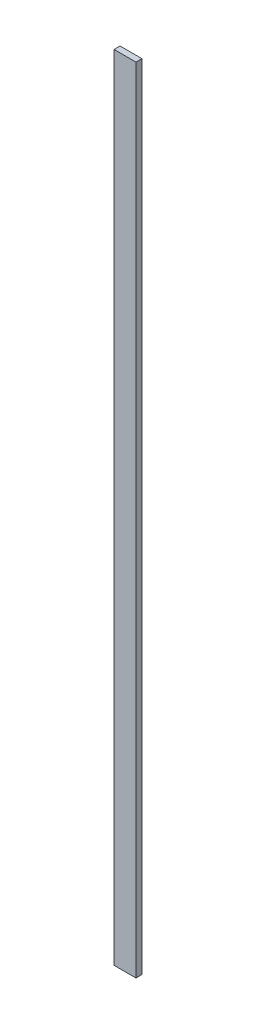
ISO-10303-21;
HEADER;
FILE_DESCRIPTION(('STEP AP214'),'2;1');
FILE_NAME('part.step','',(''),(''),'','','');
FILE_SCHEMA(('AUTOMOTIVE_DESIGN { 1 0 10303 214 1 1 1 1 }'));
ENDSEC;
DATA;
#1=APPLICATION_CONTEXT('core data for automotive mechanical design processes');
#2=APPLICATION_PROTOCOL_DEFINITION('international standard','automotive_design',2000,#1);
#3=PRODUCT_CONTEXT('',#1,'mechanical');
#4=PRODUCT('Part','Part','',(#3));
#5=PRODUCT_RELATED_PRODUCT_CATEGORY('part','',(#4));
#6=PRODUCT_DEFINITION_FORMATION('','',#4);
#7=PRODUCT_DEFINITION_CONTEXT('part definition',#1,'design');
#8=PRODUCT_DEFINITION('design','',#6,#7);
#9=PRODUCT_DEFINITION_SHAPE('','',#8);
#10=(LENGTH_UNIT() NAMED_UNIT(*) SI_UNIT(.MILLI.,.METRE.));
#11=(NAMED_UNIT(*) PLANE_ANGLE_UNIT() SI_UNIT($,.RADIAN.));
#12=(NAMED_UNIT(*) SI_UNIT($,.STERADIAN.) SOLID_ANGLE_UNIT());
#13=UNCERTAINTY_MEASURE_WITH_UNIT(LENGTH_MEASURE(1.E-05),#10,'distance_accuracy_value','');
#14=(GEOMETRIC_REPRESENTATION_CONTEXT(3) GLOBAL_UNCERTAINTY_ASSIGNED_CONTEXT((#13)) GLOBAL_UNIT_ASSIGNED_CONTEXT((#10,
#11,#12)) REPRESENTATION_CONTEXT('',''));
#15=CARTESIAN_POINT('',(0.,0.,0.));
#16=DIRECTION('',(0.,0.,1.));
#17=DIRECTION('',(1.,0.,0.));
#18=AXIS2_PLACEMENT_3D('',#15,#16,#17);
#19=CARTESIAN_POINT('',(-69.85,5054.6,19.05));
#20=DIRECTION('',(-1.,0.,0.));
#21=DIRECTION('',(0.,0.,1.));
#22=AXIS2_PLACEMENT_3D('',#19,#20,#21);
#23=PLANE('',#22);
#24=DIRECTION('',(0.,0.,-1.));
#25=VECTOR('',#24,1.);
#26=CARTESIAN_POINT('',(-69.85,0.,19.05));
#27=LINE('',#26,#25);
#28=CARTESIAN_POINT('',(-69.85,0.,19.05));
#29=VERTEX_POINT('',#28);
#30=CARTESIAN_POINT('',(-69.85,0.,-19.05));
#31=VERTEX_POINT('',#30);
#32=EDGE_CURVE('E104',#29,#31,#27,.T.);
#33=ORIENTED_EDGE('',*,*,#32,.F.);
#34=DIRECTION('',(0.,-1.,0.));
#35=VECTOR('',#34,1.);
#36=CARTESIAN_POINT('',(-69.85,5054.6,19.05));
#37=LINE('',#36,#35);
#38=CARTESIAN_POINT('',(-69.85,5054.6,19.05));
#39=VERTEX_POINT('',#38);
#40=EDGE_CURVE('E11',#39,#29,#37,.T.);
#41=ORIENTED_EDGE('',*,*,#40,.F.);
#42=DIRECTION('',(0.,0.,-1.));
#43=VECTOR('',#42,1.);
#44=CARTESIAN_POINT('',(-69.85,5054.6,19.05));
#45=LINE('',#44,#43);
#46=CARTESIAN_POINT('',(-69.85,5054.6,-19.05));
#47=VERTEX_POINT('',#46);
#48=EDGE_CURVE('E99',#39,#47,#45,.T.);
#49=ORIENTED_EDGE('',*,*,#48,.T.);
#50=DIRECTION('',(0.,-1.,0.));
#51=VECTOR('',#50,1.);
#52=CARTESIAN_POINT('',(-69.85,5054.6,-19.05));
#53=LINE('',#52,#51);
#54=EDGE_CURVE('E42',#47,#31,#53,.T.);
#55=ORIENTED_EDGE('',*,*,#54,.T.);
#56=EDGE_LOOP('',(#33,#41,#49,#55));
#57=FACE_BOUND('',#56,.T.);
#58=ADVANCED_FACE('F39',(#57),#23,.T.);
#59=CARTESIAN_POINT('',(-69.85,5054.6,19.05));
#60=DIRECTION('',(0.,0.,-1.));
#61=DIRECTION('',(-1.,0.,0.));
#62=AXIS2_PLACEMENT_3D('',#59,#60,#61);
#63=PLANE('',#62);
#64=DIRECTION('',(1.,0.,0.));
#65=VECTOR('',#64,1.);
#66=CARTESIAN_POINT('',(-69.85,0.,19.05));
#67=LINE('',#66,#65);
#68=CARTESIAN_POINT('',(69.85,0.,19.05));
#69=VERTEX_POINT('',#68);
#70=EDGE_CURVE('E72',#29,#69,#67,.T.);
#71=ORIENTED_EDGE('',*,*,#70,.T.);
#72=DIRECTION('',(0.,-1.,0.));
#73=VECTOR('',#72,1.);
#74=CARTESIAN_POINT('',(69.85,5054.6,19.05));
#75=LINE('',#74,#73);
#76=CARTESIAN_POINT('',(69.85,5054.6,19.05));
#77=VERTEX_POINT('',#76);
#78=EDGE_CURVE('E48',#77,#69,#75,.T.);
#79=ORIENTED_EDGE('',*,*,#78,.F.);
#80=DIRECTION('',(1.,0.,0.));
#81=VECTOR('',#80,1.);
#82=CARTESIAN_POINT('',(-69.85,5054.6,19.05));
#83=LINE('',#82,#81);
#84=EDGE_CURVE('E89',#39,#77,#83,.T.);
#85=ORIENTED_EDGE('',*,*,#84,.F.);
#86=ORIENTED_EDGE('',*,*,#40,.T.);
#87=EDGE_LOOP('',(#71,#79,#85,#86));
#88=FACE_BOUND('',#87,.T.);
#89=ADVANCED_FACE('F114',(#88),#63,.F.);
#90=CARTESIAN_POINT('',(69.85,5054.6,19.05));
#91=DIRECTION('',(-1.,0.,0.));
#92=DIRECTION('',(0.,0.,1.));
#93=AXIS2_PLACEMENT_3D('',#90,#91,#92);
#94=PLANE('',#93);
#95=DIRECTION('',(0.,0.,-1.));
#96=VECTOR('',#95,1.);
#97=CARTESIAN_POINT('',(69.85,0.,19.05));
#98=LINE('',#97,#96);
#99=CARTESIAN_POINT('',(69.85,0.,-19.05));
#100=VERTEX_POINT('',#99);
#101=EDGE_CURVE('E96',#69,#100,#98,.T.);
#102=ORIENTED_EDGE('',*,*,#101,.T.);
#103=DIRECTION('',(0.,-1.,0.));
#104=VECTOR('',#103,1.);
#105=CARTESIAN_POINT('',(69.85,5054.6,-19.05));
#106=LINE('',#105,#104);
#107=CARTESIAN_POINT('',(69.85,5054.6,-19.05));
#108=VERTEX_POINT('',#107);
#109=EDGE_CURVE('E93',#108,#100,#106,.T.);
#110=ORIENTED_EDGE('',*,*,#109,.F.);
#111=DIRECTION('',(0.,0.,-1.));
#112=VECTOR('',#111,1.);
#113=CARTESIAN_POINT('',(69.85,5054.6,19.05));
#114=LINE('',#113,#112);
#115=EDGE_CURVE('E84',#77,#108,#114,.T.);
#116=ORIENTED_EDGE('',*,*,#115,.F.);
#117=ORIENTED_EDGE('',*,*,#78,.T.);
#118=EDGE_LOOP('',(#102,#110,#116,#117));
#119=FACE_BOUND('',#118,.T.);
#120=ADVANCED_FACE('F94',(#119),#94,.F.);
#121=CARTESIAN_POINT('',(-69.85,5054.6,-19.05));
#122=DIRECTION('',(0.,0.,-1.));
#123=DIRECTION('',(-1.,0.,0.));
#124=AXIS2_PLACEMENT_3D('',#121,#122,#123);
#125=PLANE('',#124);
#126=DIRECTION('',(1.,0.,0.));
#127=VECTOR('',#126,1.);
#128=CARTESIAN_POINT('',(-69.85,0.,-19.05));
#129=LINE('',#128,#127);
#130=EDGE_CURVE('E107',#31,#100,#129,.T.);
#131=ORIENTED_EDGE('',*,*,#130,.F.);
#132=ORIENTED_EDGE('',*,*,#54,.F.);
#133=DIRECTION('',(1.,0.,0.));
#134=VECTOR('',#133,1.);
#135=CARTESIAN_POINT('',(-69.85,5054.6,-19.05));
#136=LINE('',#135,#134);
#137=EDGE_CURVE('E88',#47,#108,#136,.T.);
#138=ORIENTED_EDGE('',*,*,#137,.T.);
#139=ORIENTED_EDGE('',*,*,#109,.T.);
#140=EDGE_LOOP('',(#131,#132,#138,#139));
#141=FACE_BOUND('',#140,.T.);
#142=ADVANCED_FACE('F98',(#141),#125,.T.);
#143=CARTESIAN_POINT('',(0.,5054.6,0.));
#144=DIRECTION('',(0.,-1.,0.));
#145=DIRECTION('',(0.,0.,-1.));
#146=AXIS2_PLACEMENT_3D('',#143,#144,#145);
#147=PLANE('',#146);
#148=ORIENTED_EDGE('',*,*,#48,.F.);
#149=ORIENTED_EDGE('',*,*,#84,.T.);
#150=ORIENTED_EDGE('',*,*,#115,.T.);
#151=ORIENTED_EDGE('',*,*,#137,.F.);
#152=EDGE_LOOP('',(#148,#149,#150,#151));
#153=FACE_BOUND('',#152,.T.);
#154=ADVANCED_FACE('F87',(#153),#147,.F.);
#155=CARTESIAN_POINT('',(0.,0.,0.));
#156=DIRECTION('',(0.,-1.,0.));
#157=DIRECTION('',(0.,0.,-1.));
#158=AXIS2_PLACEMENT_3D('',#155,#156,#157);
#159=PLANE('',#158);
#160=ORIENTED_EDGE('',*,*,#32,.T.);
#161=ORIENTED_EDGE('',*,*,#130,.T.);
#162=ORIENTED_EDGE('',*,*,#101,.F.);
#163=ORIENTED_EDGE('',*,*,#70,.F.);
#164=EDGE_LOOP('',(#160,#161,#162,#163));
#165=FACE_BOUND('',#164,.T.);
#166=ADVANCED_FACE('F112',(#165),#159,.T.);
#167=CLOSED_SHELL('',(#58,#89,#120,#142,#154,#166));
#168=MANIFOLD_SOLID_BREP('B2',#167);
#169=ADVANCED_BREP_SHAPE_REPRESENTATION('',(#18,#168),#14);
#170=SHAPE_DEFINITION_REPRESENTATION(#9,#169);
ENDSEC;
END-ISO-10303-21;
